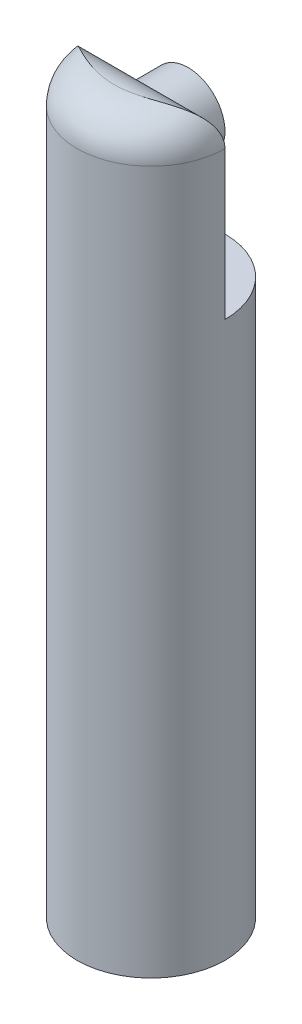
ISO-10303-21;
HEADER;
FILE_DESCRIPTION(('STEP AP214'),'2;1');
FILE_NAME('part.step','',(''),(''),'','','');
FILE_SCHEMA(('AUTOMOTIVE_DESIGN { 1 0 10303 214 1 1 1 1 }'));
ENDSEC;
DATA;
#1=APPLICATION_CONTEXT('core data for automotive mechanical design processes');
#2=APPLICATION_PROTOCOL_DEFINITION('international standard','automotive_design',2000,#1);
#3=PRODUCT_CONTEXT('',#1,'mechanical');
#4=PRODUCT('Part','Part','',(#3));
#5=PRODUCT_RELATED_PRODUCT_CATEGORY('part','',(#4));
#6=PRODUCT_DEFINITION_FORMATION('','',#4);
#7=PRODUCT_DEFINITION_CONTEXT('part definition',#1,'design');
#8=PRODUCT_DEFINITION('design','',#6,#7);
#9=PRODUCT_DEFINITION_SHAPE('','',#8);
#10=(LENGTH_UNIT() NAMED_UNIT(*) SI_UNIT(.MILLI.,.METRE.));
#11=(NAMED_UNIT(*) PLANE_ANGLE_UNIT() SI_UNIT($,.RADIAN.));
#12=(NAMED_UNIT(*) SI_UNIT($,.STERADIAN.) SOLID_ANGLE_UNIT());
#13=UNCERTAINTY_MEASURE_WITH_UNIT(LENGTH_MEASURE(1.E-05),#10,'distance_accuracy_value','');
#14=(GEOMETRIC_REPRESENTATION_CONTEXT(3) GLOBAL_UNCERTAINTY_ASSIGNED_CONTEXT((#13)) GLOBAL_UNIT_ASSIGNED_CONTEXT((#10,
#11,#12)) REPRESENTATION_CONTEXT('',''));
#15=CARTESIAN_POINT('',(0.,0.,0.));
#16=DIRECTION('',(0.,0.,1.));
#17=DIRECTION('',(1.,0.,0.));
#18=AXIS2_PLACEMENT_3D('',#15,#16,#17);
#19=CARTESIAN_POINT('',(0.,100.,0.));
#20=DIRECTION('',(0.,-1.,0.));
#21=DIRECTION('',(0.,0.,-1.));
#22=AXIS2_PLACEMENT_3D('',#19,#20,#21);
#23=CYLINDRICAL_SURFACE('',#22,10.);
#24=DIRECTION('',(0.,1.,0.));
#25=VECTOR('',#24,1.);
#26=CARTESIAN_POINT('',(10.,75.,0.));
#27=LINE('',#26,#25);
#28=CARTESIAN_POINT('',(10.,75.,0.));
#29=VERTEX_POINT('',#28);
#30=CARTESIAN_POINT('',(10.,95.,0.));
#31=VERTEX_POINT('',#30);
#32=EDGE_CURVE('E158',#29,#31,#27,.T.);
#33=ORIENTED_EDGE('',*,*,#32,.T.);
#34=CARTESIAN_POINT('',(0.,95.,0.));
#35=DIRECTION('',(0.,1.,0.));
#36=DIRECTION('',(0.,0.,1.));
#37=AXIS2_PLACEMENT_3D('',#34,#35,#36);
#38=CIRCLE('',#37,10.);
#39=CARTESIAN_POINT('',(-10.,95.,0.));
#40=VERTEX_POINT('',#39);
#41=EDGE_CURVE('E97',#31,#40,#38,.F.);
#42=ORIENTED_EDGE('',*,*,#41,.T.);
#43=DIRECTION('',(0.,-1.,0.));
#44=VECTOR('',#43,1.);
#45=CARTESIAN_POINT('',(-10.,75.,0.));
#46=LINE('',#45,#44);
#47=CARTESIAN_POINT('',(-10.,75.,0.));
#48=VERTEX_POINT('',#47);
#49=EDGE_CURVE('E83',#40,#48,#46,.T.);
#50=ORIENTED_EDGE('',*,*,#49,.T.);
#51=CARTESIAN_POINT('',(0.,75.,0.));
#52=DIRECTION('',(0.,-1.,0.));
#53=DIRECTION('',(0.,0.,-1.));
#54=AXIS2_PLACEMENT_3D('',#51,#52,#53);
#55=CIRCLE('',#54,10.);
#56=EDGE_CURVE('E174',#48,#29,#55,.T.);
#57=ORIENTED_EDGE('',*,*,#56,.T.);
#58=EDGE_LOOP('',(#33,#42,#50,#57));
#59=FACE_BOUND('',#58,.T.);
#60=CARTESIAN_POINT('',(0.,0.,0.));
#61=DIRECTION('',(0.,1.,0.));
#62=DIRECTION('',(0.,0.,1.));
#63=AXIS2_PLACEMENT_3D('',#60,#61,#62);
#64=CIRCLE('',#63,10.);
#65=CARTESIAN_POINT('',(0.,0.,10.));
#66=VERTEX_POINT('',#65);
#67=EDGE_CURVE('E167',#66,#66,#64,.T.);
#68=ORIENTED_EDGE('',*,*,#67,.T.);
#69=EDGE_LOOP('',(#68));
#70=FACE_BOUND('',#69,.T.);
#71=ADVANCED_FACE('F42',(#59,#70),#23,.T.);
#72=CARTESIAN_POINT('',(0.,0.,0.));
#73=DIRECTION('',(0.,1.,0.));
#74=DIRECTION('',(0.,0.,1.));
#75=AXIS2_PLACEMENT_3D('',#72,#73,#74);
#76=PLANE('',#75);
#77=CARTESIAN_POINT('',(0.,0.,0.));
#78=DIRECTION('',(0.,1.,0.));
#79=DIRECTION('',(0.,0.,1.));
#80=AXIS2_PLACEMENT_3D('',#77,#78,#79);
#81=CIRCLE('',#80,5.);
#82=CARTESIAN_POINT('',(0.,0.,5.));
#83=VERTEX_POINT('',#82);
#84=EDGE_CURVE('E162',#83,#83,#81,.T.);
#85=ORIENTED_EDGE('',*,*,#84,.T.);
#86=EDGE_LOOP('',(#85));
#87=FACE_BOUND('',#86,.T.);
#88=ORIENTED_EDGE('',*,*,#67,.F.);
#89=EDGE_LOOP('',(#88));
#90=FACE_BOUND('',#89,.T.);
#91=ADVANCED_FACE('F117',(#87,#90),#76,.F.);
#92=CARTESIAN_POINT('',(0.,10.,0.));
#93=DIRECTION('',(0.,-1.,0.));
#94=DIRECTION('',(0.,0.,-1.));
#95=AXIS2_PLACEMENT_3D('',#92,#93,#94);
#96=CYLINDRICAL_SURFACE('',#95,5.);
#97=CARTESIAN_POINT('',(0.,10.,0.));
#98=DIRECTION('',(0.,1.,0.));
#99=DIRECTION('',(0.,0.,1.));
#100=AXIS2_PLACEMENT_3D('',#97,#98,#99);
#101=CIRCLE('',#100,5.);
#102=CARTESIAN_POINT('',(0.,10.,5.));
#103=VERTEX_POINT('',#102);
#104=EDGE_CURVE('E163',#103,#103,#101,.T.);
#105=ORIENTED_EDGE('',*,*,#104,.T.);
#106=EDGE_LOOP('',(#105));
#107=FACE_BOUND('',#106,.T.);
#108=ORIENTED_EDGE('',*,*,#84,.F.);
#109=EDGE_LOOP('',(#108));
#110=FACE_BOUND('',#109,.T.);
#111=ADVANCED_FACE('F120',(#107,#110),#96,.F.);
#112=CARTESIAN_POINT('',(0.,10.,0.));
#113=DIRECTION('',(0.,1.,0.));
#114=DIRECTION('',(0.,0.,1.));
#115=AXIS2_PLACEMENT_3D('',#112,#113,#114);
#116=PLANE('',#115);
#117=ORIENTED_EDGE('',*,*,#104,.F.);
#118=EDGE_LOOP('',(#117));
#119=FACE_BOUND('',#118,.T.);
#120=ADVANCED_FACE('F124',(#119),#116,.F.);
#121=CARTESIAN_POINT('',(10.,75.,-10.));
#122=DIRECTION('',(0.,-1.,0.));
#123=DIRECTION('',(0.,0.,-1.));
#124=AXIS2_PLACEMENT_3D('',#121,#122,#123);
#125=PLANE('',#124);
#126=ORIENTED_EDGE('',*,*,#56,.F.);
#127=DIRECTION('',(1.,0.,0.));
#128=VECTOR('',#127,1.);
#129=CARTESIAN_POINT('',(10.,75.,0.));
#130=LINE('',#129,#128);
#131=EDGE_CURVE('E151',#48,#29,#130,.T.);
#132=ORIENTED_EDGE('',*,*,#131,.T.);
#133=EDGE_LOOP('',(#126,#132));
#134=FACE_BOUND('',#133,.T.);
#135=ADVANCED_FACE('F128',(#134),#125,.F.);
#136=CARTESIAN_POINT('',(0.,0.,0.));
#137=DIRECTION('',(0.,0.,1.));
#138=DIRECTION('',(1.,0.,0.));
#139=AXIS2_PLACEMENT_3D('',#136,#137,#138);
#140=PLANE('',#139);
#141=ORIENTED_EDGE('',*,*,#49,.F.);
#142=DIRECTION('',(-1.,0.,0.));
#143=VECTOR('',#142,1.);
#144=CARTESIAN_POINT('',(10.,95.,0.));
#145=LINE('',#144,#143);
#146=CARTESIAN_POINT('',(-4.00134261883828,95.,0.));
#147=VERTEX_POINT('',#146);
#148=EDGE_CURVE('E58',#40,#147,#145,.F.);
#149=ORIENTED_EDGE('',*,*,#148,.T.);
#150=CARTESIAN_POINT('',(0.,92.0017909934982,0.));
#151=DIRECTION('',(0.,0.,1.));
#152=DIRECTION('',(1.,0.,0.));
#153=AXIS2_PLACEMENT_3D('',#150,#151,#152);
#154=CIRCLE('',#153,5.);
#155=CARTESIAN_POINT('',(4.00134261883828,95.,0.));
#156=VERTEX_POINT('',#155);
#157=EDGE_CURVE('E96',#147,#156,#154,.T.);
#158=ORIENTED_EDGE('',*,*,#157,.T.);
#159=DIRECTION('',(-1.,0.,0.));
#160=VECTOR('',#159,1.);
#161=CARTESIAN_POINT('',(10.,95.,0.));
#162=LINE('',#161,#160);
#163=EDGE_CURVE('E179',#156,#31,#162,.F.);
#164=ORIENTED_EDGE('',*,*,#163,.T.);
#165=ORIENTED_EDGE('',*,*,#32,.F.);
#166=ORIENTED_EDGE('',*,*,#131,.F.);
#167=EDGE_LOOP('',(#141,#149,#158,#164,#165,#166));
#168=FACE_BOUND('',#167,.T.);
#169=ADVANCED_FACE('F132',(#168),#140,.F.);
#170=CARTESIAN_POINT('',(0.,92.0017909934982,-5.));
#171=DIRECTION('',(0.,0.,1.));
#172=DIRECTION('',(1.,0.,0.));
#173=AXIS2_PLACEMENT_3D('',#170,#171,#172);
#174=CYLINDRICAL_SURFACE('',#173,5.);
#175=CARTESIAN_POINT('',(0.,92.0017909934982,-5.));
#176=DIRECTION('',(0.,0.,1.));
#177=DIRECTION('',(1.,0.,0.));
#178=AXIS2_PLACEMENT_3D('',#175,#176,#177);
#179=CIRCLE('',#178,5.);
#180=CARTESIAN_POINT('',(5.,92.0017909934982,-5.));
#181=VERTEX_POINT('',#180);
#182=EDGE_CURVE('E146',#181,#181,#179,.T.);
#183=ORIENTED_EDGE('',*,*,#182,.T.);
#184=EDGE_LOOP('',(#183));
#185=FACE_BOUND('',#184,.T.);
#186=ORIENTED_EDGE('',*,*,#157,.F.);
#187=CARTESIAN_POINT('',(-4.00134261883828,95.,0.));
#188=CARTESIAN_POINT('',(-3.9192571845388,95.1095829535445,-5.83858758955765E-06));
#189=CARTESIAN_POINT('',(-3.83268707317241,95.2157063488774,0.00360146017436887));
#190=CARTESIAN_POINT('',(-3.65143368777091,95.420215841002,0.0166388719608626));
#191=CARTESIAN_POINT('',(-3.55675892724819,95.5186098536572,0.0260629378787019));
#192=CARTESIAN_POINT('',(-3.36023448688246,95.7068280018118,0.0493059806480449));
#193=CARTESIAN_POINT('',(-3.25840408570384,95.7966737368977,0.0631134763719476));
#194=CARTESIAN_POINT('',(-3.04808090020451,95.9675942466483,0.0937488894681588));
#195=CARTESIAN_POINT('',(-2.93958638176028,96.0486667230656,0.110577595223049));
#196=CARTESIAN_POINT('',(-2.60573882360792,96.2776101871982,0.16345033913635));
#197=CARTESIAN_POINT('',(-2.37121782171549,96.4119742164138,0.201996883607484));
#198=CARTESIAN_POINT('',(-2.00546856441407,96.5839686973408,0.257145889542302));
#199=CARTESIAN_POINT('',(-1.8811170050831,96.6364056204063,0.275097310574173));
#200=CARTESIAN_POINT('',(-1.62835222141872,96.7311299002371,0.308974454951973));
#201=CARTESIAN_POINT('',(-1.49994093983002,96.7734220309253,0.324901129435451));
#202=CARTESIAN_POINT('',(-1.23349334425648,96.8493273095916,0.354385838872365));
#203=CARTESIAN_POINT('',(-1.095292046251,96.8824210662942,0.367791843906104));
#204=CARTESIAN_POINT('',(-0.8162188744367,96.9367671678984,0.390249422428273));
#205=CARTESIAN_POINT('',(-0.675346970266431,96.9580193780931,0.399300946380835));
#206=CARTESIAN_POINT('',(-0.392192313227509,96.9884173244512,0.412356583449048));
#207=CARTESIAN_POINT('',(-0.24991092154572,96.9975737745634,0.416365163256121));
#208=CARTESIAN_POINT('',(0.0349586163572576,97.0036977208634,0.419038477346492));
#209=CARTESIAN_POINT('',(0.177546739129846,97.0006661178544,0.417703606557386));
#210=CARTESIAN_POINT('',(0.450521964056117,96.9831792037466,0.410111368887263));
#211=CARTESIAN_POINT('',(0.580980683027787,96.9696480102895,0.404252385138154));
#212=CARTESIAN_POINT('',(0.840183148192167,96.9324335278886,0.388480937347974));
#213=CARTESIAN_POINT('',(0.968926966713717,96.9087506685155,0.378568644824621));
#214=CARTESIAN_POINT('',(1.22396877060431,96.8514295110315,0.355307839030517));
#215=CARTESIAN_POINT('',(1.35026475528011,96.81778340733,0.341956632653258));
#216=CARTESIAN_POINT('',(1.59958118417476,96.7408186711508,0.312651388253051));
#217=CARTESIAN_POINT('',(1.72260033156009,96.6974962710382,0.296696337031151));
#218=CARTESIAN_POINT('',(2.09154867201583,96.5511279065187,0.245537361998741));
#219=CARTESIAN_POINT('',(2.33131891351315,96.4330397210742,0.207669000781896));
#220=CARTESIAN_POINT('',(2.7889233226409,96.160252357921,0.134441145301672));
#221=CARTESIAN_POINT('',(3.0067892051408,96.0056072308492,0.0990780463061169));
#222=CARTESIAN_POINT('',(3.35791603445116,95.7113596332869,0.0492984611285915));
#223=CARTESIAN_POINT('',(3.49762695070718,95.579968592569,0.0317852598472485));
#224=CARTESIAN_POINT('',(3.69555524769179,95.3710788038803,0.0132978025890632));
#225=CARTESIAN_POINT('',(3.75963631791964,95.2994221985153,0.00843163601791898));
#226=CARTESIAN_POINT('',(3.88366417488826,95.1524120778501,0.00178128955857572));
#227=CARTESIAN_POINT('',(3.9436085419534,95.0770564422462,-1.10096845067738E-06));
#228=CARTESIAN_POINT('',(4.00134261883828,95.,0.));
#229=B_SPLINE_CURVE_WITH_KNOTS('',3,(#187,#188,#189,#190,#191,#192,#193,#194,#195,#196,#197,
#198,#199,#200,#201,#202,#203,#204,#205,#206,#207,#208,#209,#210,#211,#212,#213,#214,#215,#216,
#217,#218,#219,#220,#221,#222,#223,#224,#225,#226,#227,#228),.UNSPECIFIED.,.F.,.F.,(4,2,2,2,2,2,
2,2,2,2,2,2,2,2,2,2,2,2,2,2,4),(0.,0.410471910831993,0.820517812449723,1.22949845723416,
1.63858598076117,2.45344733356874,2.86154452523256,3.26944929665043,3.69710485492519,
4.12476527802506,4.55204664177156,4.97929642628234,5.37269568820103,5.76607830496245,
6.15976993194573,6.5536151176962,7.3597901080433,8.16478051628188,8.74103771809149,
9.02960910564069,9.3183478806622),.UNSPECIFIED.);
#230=EDGE_CURVE('E11',#147,#156,#229,.T.);
#231=ORIENTED_EDGE('',*,*,#230,.T.);
#232=EDGE_LOOP('',(#186,#231));
#233=FACE_BOUND('',#232,.T.);
#234=ADVANCED_FACE('F135',(#185,#233),#174,.T.);
#235=CARTESIAN_POINT('',(0.,92.0017909934982,-5.));
#236=DIRECTION('',(0.,0.,1.));
#237=DIRECTION('',(1.,0.,0.));
#238=AXIS2_PLACEMENT_3D('',#235,#236,#237);
#239=PLANE('',#238);
#240=ORIENTED_EDGE('',*,*,#182,.F.);
#241=EDGE_LOOP('',(#240));
#242=FACE_BOUND('',#241,.T.);
#243=ADVANCED_FACE('F112',(#242),#239,.F.);
#244=CARTESIAN_POINT('',(0.,95.,5.));
#245=DIRECTION('',(1.,0.,0.));
#246=DIRECTION('',(0.,0.,-1.));
#247=AXIS2_PLACEMENT_3D('',#244,#245,#246);
#248=CYLINDRICAL_SURFACE('',#247,5.);
#249=ORIENTED_EDGE('',*,*,#230,.F.);
#250=ORIENTED_EDGE('',*,*,#148,.F.);
#251=CARTESIAN_POINT('',(-10.,95.,0.));
#252=CARTESIAN_POINT('',(-10.0000186621462,95.109481128906,-2.67095448372106E-05));
#253=CARTESIAN_POINT('',(-9.99640510464395,95.2189487809777,0.00359468229512016));
#254=CARTESIAN_POINT('',(-9.98205407947085,95.436887226979,0.0179345321929953));
#255=CARTESIAN_POINT('',(-9.97132069824936,95.5453585565659,0.0286489191928138));
#256=CARTESIAN_POINT('',(-9.94296936316064,95.7597128234585,0.0568773691555696));
#257=CARTESIAN_POINT('',(-9.9253998926326,95.8656085286161,0.0743435411466067));
#258=CARTESIAN_POINT('',(-9.88362272288509,96.0748003444367,0.115722034743118));
#259=CARTESIAN_POINT('',(-9.85941439914113,96.178096209531,0.139634962798709));
#260=CARTESIAN_POINT('',(-9.80472959176057,96.3811629860674,0.193401065176742));
#261=CARTESIAN_POINT('',(-9.77426730480449,96.4809412916891,0.223240780610438));
#262=CARTESIAN_POINT('',(-9.707403231472,96.6766699717462,0.28837204733803));
#263=CARTESIAN_POINT('',(-9.67099881241379,96.7726186258839,0.323666014786202));
#264=CARTESIAN_POINT('',(-9.5533328841649,97.0542415608907,0.436999216654399));
#265=CARTESIAN_POINT('',(-9.46365532149096,97.2335590300103,0.522453277561387));
#266=CARTESIAN_POINT('',(-9.29879424318218,97.5153010191273,0.676836950648343));
#267=CARTESIAN_POINT('',(-9.22891680346262,97.6232678349325,0.741625025645634));
#268=CARTESIAN_POINT('',(-9.08164924199558,97.8304836258159,0.876454251929069));
#269=CARTESIAN_POINT('',(-9.00425709687325,97.9297302391538,0.946496816854011));
#270=CARTESIAN_POINT('',(-8.76185518300568,98.2144481017106,1.16279508776863));
#271=CARTESIAN_POINT('',(-8.5866781068222,98.3868001635109,1.31516605491869));
#272=CARTESIAN_POINT('',(-8.27203822653394,98.6501577584139,1.57950470468883));
#273=CARTESIAN_POINT('',(-8.13803760630387,98.7499210627327,1.68957734990039));
#274=CARTESIAN_POINT('',(-7.86104722004844,98.9344377621682,1.91115476753484));
#275=CARTESIAN_POINT('',(-7.71805401740357,99.0191853710499,2.0226600743532));
#276=CARTESIAN_POINT('',(-7.42409710519104,99.174886719524,2.24522141218175));
#277=CARTESIAN_POINT('',(-7.27312197218609,99.2458199696341,2.35627654017932));
#278=CARTESIAN_POINT('',(-6.96431462329925,99.3750429806096,2.57610843955653));
#279=CARTESIAN_POINT('',(-6.8064826711737,99.4333332272884,2.68488529833457));
#280=CARTESIAN_POINT('',(-6.4333751897412,99.5553855198772,2.93283423400923));
#281=CARTESIAN_POINT('',(-6.21582430709963,99.6149701922133,3.07064395790101));
#282=CARTESIAN_POINT('',(-5.77134687809699,99.7175177765771,3.3370492171827));
#283=CARTESIAN_POINT('',(-5.54441734026438,99.7604753391232,3.46564177628678));
#284=CARTESIAN_POINT('',(-5.08241188023016,99.8327165244243,3.71112074230516));
#285=CARTESIAN_POINT('',(-4.84734108268232,99.8620085869544,3.82801433933006));
#286=CARTESIAN_POINT('',(-4.36990210844634,99.9098326852446,4.04804635997963));
#287=CARTESIAN_POINT('',(-4.12753655342137,99.9283685392358,4.15118965464965));
#288=CARTESIAN_POINT('',(-3.63869429345518,99.9572960234078,4.34095196067851));
#289=CARTESIAN_POINT('',(-3.39228155020723,99.9677660337299,4.42772365063253));
#290=CARTESIAN_POINT('',(-2.89421757355262,99.9833068989249,4.5842745680929));
#291=CARTESIAN_POINT('',(-2.64257154616481,99.9883828802061,4.65406988096091));
#292=CARTESIAN_POINT('',(-2.07767772316836,99.996106694137,4.78899146958065));
#293=CARTESIAN_POINT('',(-1.76330130773517,99.9979519341869,4.84953927754232));
#294=CARTESIAN_POINT('',(-1.24917414857425,99.999499250028,4.92393586920952));
#295=CARTESIAN_POINT('',(-1.05068743231913,99.9997457724766,4.94678266441202));
#296=CARTESIAN_POINT('',(-0.72996052556808,99.9999435027498,4.97409886461233));
#297=CARTESIAN_POINT('',(-0.608031310894953,99.9999721984027,4.98225936203668));
#298=CARTESIAN_POINT('',(-0.413828993335563,99.9999942465566,4.99169777967294));
#299=CARTESIAN_POINT('',(-0.341624193407272,99.999997249708,4.99442549880829));
#300=CARTESIAN_POINT('',(-0.212942289660993,99.9999998037038,4.99789212412415));
#301=CARTESIAN_POINT('',(-0.15647337716182,99.999999965158,4.9989352311098));
#302=CARTESIAN_POINT('',(-0.0666676462309068,99.9999999808091,4.99983334427297));
#303=CARTESIAN_POINT('',(-0.0333337370939474,99.9999999338005,5.00000004848213));
#304=CARTESIAN_POINT('',(0.,100.,5.00000000000003));
#305=B_SPLINE_CURVE_WITH_KNOTS('',3,(#251,#252,#253,#254,#255,#256,#257,#258,#259,#260,#261,
#262,#263,#264,#265,#266,#267,#268,#269,#270,#271,#272,#273,#274,#275,#276,#277,#278,#279,#280,
#281,#282,#283,#284,#285,#286,#287,#288,#289,#290,#291,#292,#293,#294,#295,#296,#297,#298,#299,
#300,#301,#302,#303,#304),.UNSPECIFIED.,.F.,.F.,(4,2,2,2,2,2,2,2,2,2,2,2,2,2,2,2,2,2,2,2,2,2,2,
2,2,2,4),(0.,0.328302730117657,0.656417192510453,0.982245796518992,1.30810506211666,
1.63323263819663,1.95850465611579,2.60947408305884,3.04098213308044,3.47260669285976,
4.33622925737949,4.93572989894279,5.53546105549433,6.13607507084202,6.73666600322207,
7.52867879459255,8.32094619082361,9.1127236350197,9.90421984242299,10.6879240924535,
11.4708828531573,12.4298889508044,13.0289555962828,13.3954793452464,13.612232508259,
13.7816597364275,13.8816609864198),.UNSPECIFIED.);
#306=CARTESIAN_POINT('',(0.,100.,5.));
#307=VERTEX_POINT('',#306);
#308=EDGE_CURVE('E47',#307,#40,#305,.F.);
#309=ORIENTED_EDGE('',*,*,#308,.F.);
#310=CARTESIAN_POINT('',(0.,100.,5.00000000000003));
#311=CARTESIAN_POINT('',(0.0333342246904434,99.9999999919485,5.00000000062013));
#312=CARTESIAN_POINT('',(0.0666679318382451,100.000000009193,4.99983331950454));
#313=CARTESIAN_POINT('',(0.11194429202892,99.9999999627472,4.99938055749996));
#314=CARTESIAN_POINT('',(0.123888373596873,99.9999999438894,4.99923971709066));
#315=CARTESIAN_POINT('',(0.183608620272589,99.9999997989185,4.99842851985548));
#316=CARTESIAN_POINT('',(0.231380854224731,99.9999995207598,4.99743720782266));
#317=CARTESIAN_POINT('',(0.327822840911283,99.9999974234562,4.99474509388247));
#318=CARTESIAN_POINT('',(0.376492223332792,99.9999955748401,4.99303104100167));
#319=CARTESIAN_POINT('',(0.450934898986961,99.9999898487715,4.98986613856566));
#320=CARTESIAN_POINT('',(0.476719305099431,99.9999873330636,4.98867015770637));
#321=CARTESIAN_POINT('',(0.605628485689679,99.9999709676357,4.9821925199474));
#322=CARTESIAN_POINT('',(0.708680289859203,99.9999457589226,4.97541903753608));
#323=CARTESIAN_POINT('',(1.01784248879754,99.9997828571157,4.95032502497093));
#324=CARTESIAN_POINT('',(1.22358537445785,99.9995576640486,4.92723825641113));
#325=CARTESIAN_POINT('',(1.63342690119004,99.9983600344552,4.86869876846174));
#326=CARTESIAN_POINT('',(1.83752419911383,99.9973870398291,4.83323682401451));
#327=CARTESIAN_POINT('',(2.34405286043905,99.9930875369004,4.72987559488323));
#328=CARTESIAN_POINT('',(2.64500081144544,99.9888324467156,4.65461280939048));
#329=CARTESIAN_POINT('',(3.23969663258352,99.9736216406297,4.47964559384549));
#330=CARTESIAN_POINT('',(3.53343942059888,99.9626613290149,4.37992442829221));
#331=CARTESIAN_POINT('',(4.11257118853161,99.9299576254203,4.15853862402556));
#332=CARTESIAN_POINT('',(4.3979428378552,99.9081933343874,4.03683174788168));
#333=CARTESIAN_POINT('',(4.95831241644302,99.8493945392217,3.77468044275884));
#334=CARTESIAN_POINT('',(5.23331220221517,99.8123627821781,3.63423938771124));
#335=CARTESIAN_POINT('',(5.70277195713379,99.7303037813628,3.37592942545357));
#336=CARTESIAN_POINT('',(5.89988110128237,99.6897263547158,3.26144223521077));
#337=CARTESIAN_POINT('',(6.28681434994671,99.5954477346053,3.02566911424512));
#338=CARTESIAN_POINT('',(6.47663821465877,99.5417461095711,2.904382960049));
#339=CARTESIAN_POINT('',(6.84763717279321,99.4193105142843,2.657209181453));
#340=CARTESIAN_POINT('',(7.02883169395037,99.3506124651626,2.53133314136388));
#341=CARTESIAN_POINT('',(7.38184229370282,99.196104710065,2.27697873907008));
#342=CARTESIAN_POINT('',(7.55365964047622,99.1102973253128,2.14850073199631));
#343=CARTESIAN_POINT('',(7.95008958438294,98.8831364050198,1.84244258513636));
#344=CARTESIAN_POINT('',(8.16983186428416,98.7330812496108,1.66483209803055));
#345=CARTESIAN_POINT('',(8.58323482390857,98.3920074196377,1.31853681797523));
#346=CARTESIAN_POINT('',(8.77692328366495,98.2010329482229,1.14984263640582));
#347=CARTESIAN_POINT('',(9.09285473514287,97.8215872031395,0.866968422252701));
#348=CARTESIAN_POINT('',(9.22150334687803,97.641418327926,0.748868635196722));
#349=CARTESIAN_POINT('',(9.45380103481113,97.2551100622395,0.531956521522456));
#350=CARTESIAN_POINT('',(9.55747462820606,97.0489964461161,0.433125297884917));
#351=CARTESIAN_POINT('',(9.72154772342875,96.6469157285514,0.274861264411679));
#352=CARTESIAN_POINT('',(9.78612438703671,96.4541451985123,0.211727452652631));
#353=CARTESIAN_POINT('',(9.86474352404259,96.1559755637524,0.134375287583743));
#354=CARTESIAN_POINT('',(9.88790464516985,96.0551154874339,0.111486992878856));
#355=CARTESIAN_POINT('',(9.92790705749827,95.8509772906148,0.0718531712626069));
#356=CARTESIAN_POINT('',(9.94475070771367,95.7477000880317,0.0551053514818556));
#357=CARTESIAN_POINT('',(9.97214835117934,95.5374817981561,0.0278229570266679));
#358=CARTESIAN_POINT('',(9.98257742794377,95.4305083559682,0.0174118201305885));
#359=CARTESIAN_POINT('',(9.99651089353284,95.2156944435843,0.00348892643664454));
#360=CARTESIAN_POINT('',(10.0000170188917,95.1078541976313,-2.4560547630878E-05));
#361=CARTESIAN_POINT('',(10.,95.,0.));
#362=B_SPLINE_CURVE_WITH_KNOTS('',3,(#310,#311,#312,#313,#314,#315,#316,#317,#318,#319,#320,
#321,#322,#323,#324,#325,#326,#327,#328,#329,#330,#331,#332,#333,#334,#335,#336,#337,#338,#339,
#340,#341,#342,#343,#344,#345,#346,#347,#348,#349,#350,#351,#352,#353,#354,#355,#356,#357,#358,
#359,#360,#361),.UNSPECIFIED.,.F.,.F.,(4,2,2,2,2,2,2,2,2,2,2,2,2,2,2,2,2,2,2,2,2,2,2,2,2,4),(0.,
0.100001249992197,0.135835934097826,0.279178118292439,0.42527123528673,0.502707092721602,
0.812484968795602,1.43316188447759,2.05430247475667,2.98380240403824,3.9139401211723,
4.84588413513619,5.77766053669958,6.47173074753722,7.16582378496708,7.85827214717592,
8.55062662875167,9.50715874425213,10.462662727695,11.2125799031296,11.9617578806476,
12.59739247633,12.9150162436145,13.2325212882739,13.5560283356812,13.8794542251495),.UNSPECIFIED.);
#363=EDGE_CURVE('E92',#31,#307,#362,.F.);
#364=ORIENTED_EDGE('',*,*,#363,.F.);
#365=ORIENTED_EDGE('',*,*,#163,.F.);
#366=EDGE_LOOP('',(#249,#250,#309,#364,#365));
#367=FACE_BOUND('',#366,.T.);
#368=ADVANCED_FACE('F90',(#367),#248,.T.);
#369=CARTESIAN_POINT('',(0.,95.,0.));
#370=DIRECTION('',(0.,1.,0.));
#371=DIRECTION('',(0.,0.,1.));
#372=AXIS2_PLACEMENT_3D('',#369,#370,#371);
#373=DEGENERATE_TOROIDAL_SURFACE('',#372,5.,5.,.T.);
#374=ORIENTED_EDGE('',*,*,#308,.T.);
#375=ORIENTED_EDGE('',*,*,#41,.F.);
#376=ORIENTED_EDGE('',*,*,#363,.T.);
#377=EDGE_LOOP('',(#374,#375,#376));
#378=FACE_BOUND('',#377,.T.);
#379=ADVANCED_FACE('F44',(#378),#373,.T.);
#380=CLOSED_SHELL('',(#71,#91,#111,#120,#135,#169,#234,#243,#368,#379));
#381=MANIFOLD_SOLID_BREP('B2',#380);
#382=ADVANCED_BREP_SHAPE_REPRESENTATION('',(#18,#381),#14);
#383=SHAPE_DEFINITION_REPRESENTATION(#9,#382);
ENDSEC;
END-ISO-10303-21;
